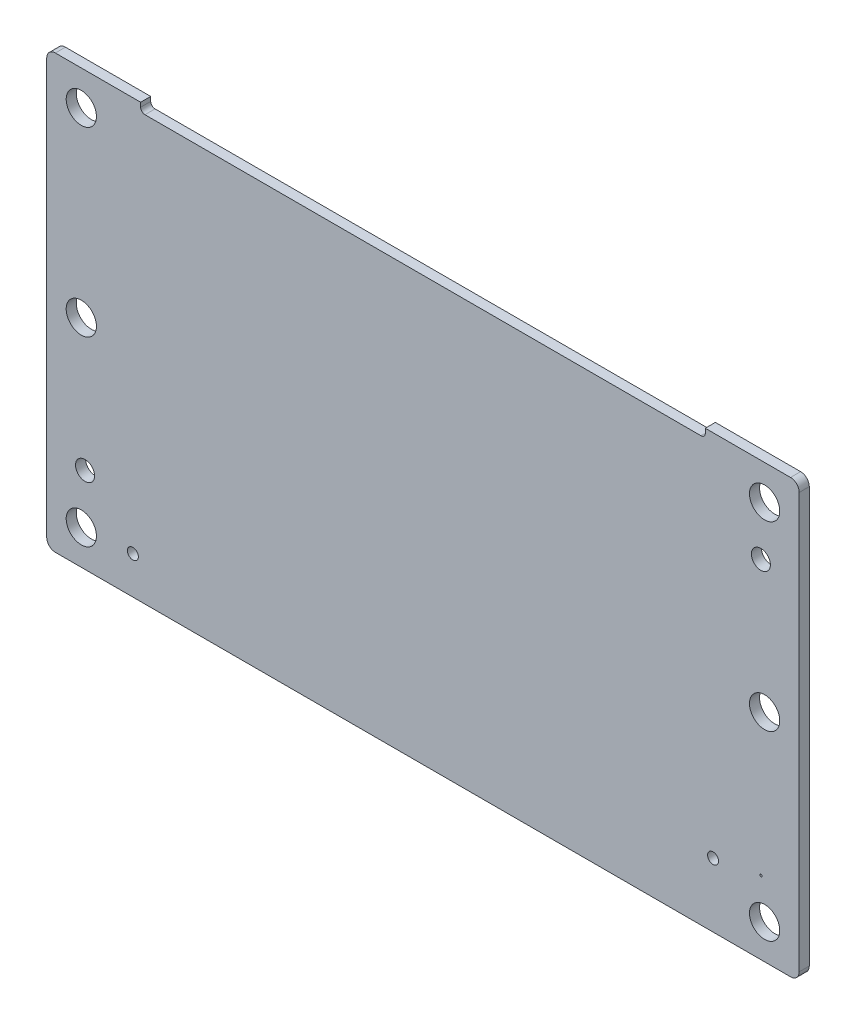
ISO-10303-21;
HEADER;
FILE_DESCRIPTION(('STEP AP214'),'2;1');
FILE_NAME('part.step','',(''),(''),'','','');
FILE_SCHEMA(('AUTOMOTIVE_DESIGN { 1 0 10303 214 1 1 1 1 }'));
ENDSEC;
DATA;
#1=APPLICATION_CONTEXT('core data for automotive mechanical design processes');
#2=APPLICATION_PROTOCOL_DEFINITION('international standard','automotive_design',2000,#1);
#3=PRODUCT_CONTEXT('',#1,'mechanical');
#4=PRODUCT('Part','Part','',(#3));
#5=PRODUCT_RELATED_PRODUCT_CATEGORY('part','',(#4));
#6=PRODUCT_DEFINITION_FORMATION('','',#4);
#7=PRODUCT_DEFINITION_CONTEXT('part definition',#1,'design');
#8=PRODUCT_DEFINITION('design','',#6,#7);
#9=PRODUCT_DEFINITION_SHAPE('','',#8);
#10=(LENGTH_UNIT() NAMED_UNIT(*) SI_UNIT(.MILLI.,.METRE.));
#11=(NAMED_UNIT(*) PLANE_ANGLE_UNIT() SI_UNIT($,.RADIAN.));
#12=(NAMED_UNIT(*) SI_UNIT($,.STERADIAN.) SOLID_ANGLE_UNIT());
#13=UNCERTAINTY_MEASURE_WITH_UNIT(LENGTH_MEASURE(1.E-05),#10,'distance_accuracy_value','');
#14=(GEOMETRIC_REPRESENTATION_CONTEXT(3) GLOBAL_UNCERTAINTY_ASSIGNED_CONTEXT((#13)) GLOBAL_UNIT_ASSIGNED_CONTEXT((#10,
#11,#12)) REPRESENTATION_CONTEXT('',''));
#15=CARTESIAN_POINT('',(0.,0.,0.));
#16=DIRECTION('',(0.,0.,1.));
#17=DIRECTION('',(1.,0.,0.));
#18=AXIS2_PLACEMENT_3D('',#15,#16,#17);
#19=CARTESIAN_POINT('',(0.,0.,1.16399999999992));
#20=DIRECTION('',(0.,0.,1.));
#21=DIRECTION('',(1.,0.,0.));
#22=AXIS2_PLACEMENT_3D('',#19,#20,#21);
#23=PLANE('',#22);
#24=CARTESIAN_POINT('',(0.4319999996,5.9180000004,1.16399999999992));
#25=DIRECTION('',(0.,0.,1.));
#26=DIRECTION('',(1.,0.,0.));
#27=AXIS2_PLACEMENT_3D('',#24,#25,#26);
#28=CIRCLE('',#27,1.0999999971);
#29=CARTESIAN_POINT('',(1.5319999967,5.9180000004,1.16399999999992));
#30=VERTEX_POINT('',#29);
#31=EDGE_CURVE('E222',#30,#30,#28,.F.);
#32=ORIENTED_EDGE('',*,*,#31,.T.);
#33=EDGE_LOOP('',(#32));
#34=FACE_BOUND('',#33,.T.);
#35=CARTESIAN_POINT('',(78.5700000098,4.4300000046,1.16399999999992));
#36=DIRECTION('',(0.,0.,1.));
#37=DIRECTION('',(1.,0.,0.));
#38=AXIS2_PLACEMENT_3D('',#35,#36,#37);
#39=CIRCLE('',#38,0.125000004);
#40=CARTESIAN_POINT('',(78.6950000138,4.4300000046,1.16399999999992));
#41=VERTEX_POINT('',#40);
#42=EDGE_CURVE('E225',#41,#41,#39,.F.);
#43=ORIENTED_EDGE('',*,*,#42,.T.);
#44=EDGE_LOOP('',(#43));
#45=FACE_BOUND('',#44,.T.);
#46=CARTESIAN_POINT('',(78.5700000098,36.0800000014,1.16399999999992));
#47=DIRECTION('',(0.,0.,1.));
#48=DIRECTION('',(1.,0.,0.));
#49=AXIS2_PLACEMENT_3D('',#46,#47,#48);
#50=CIRCLE('',#49,1.0999999971);
#51=CARTESIAN_POINT('',(79.6700000069,36.0800000014,1.16399999999992));
#52=VERTEX_POINT('',#51);
#53=EDGE_CURVE('E228',#52,#52,#50,.F.);
#54=ORIENTED_EDGE('',*,*,#53,.T.);
#55=EDGE_LOOP('',(#54));
#56=FACE_BOUND('',#55,.T.);
#57=CARTESIAN_POINT('',(78.999999988,41.9999999978,1.16399999999992));
#58=DIRECTION('',(0.,0.,1.));
#59=DIRECTION('',(1.,0.,0.));
#60=AXIS2_PLACEMENT_3D('',#57,#58,#59);
#61=CIRCLE('',#60,1.7500000052);
#62=CARTESIAN_POINT('',(80.7499999932,41.9999999978,1.16399999999992));
#63=VERTEX_POINT('',#62);
#64=EDGE_CURVE('E231',#63,#63,#61,.F.);
#65=ORIENTED_EDGE('',*,*,#64,.T.);
#66=EDGE_LOOP('',(#65));
#67=FACE_BOUND('',#66,.T.);
#68=CARTESIAN_POINT('',(78.999999988,21.0000000116,1.16399999999992));
#69=DIRECTION('',(0.,0.,1.));
#70=DIRECTION('',(1.,0.,0.));
#71=AXIS2_PLACEMENT_3D('',#68,#69,#70);
#72=CIRCLE('',#71,1.7500000052);
#73=CARTESIAN_POINT('',(80.7499999932,21.0000000116,1.16399999999992));
#74=VERTEX_POINT('',#73);
#75=EDGE_CURVE('E234',#74,#74,#72,.F.);
#76=ORIENTED_EDGE('',*,*,#75,.T.);
#77=EDGE_LOOP('',(#76));
#78=FACE_BOUND('',#77,.T.);
#79=CARTESIAN_POINT('',(78.999999988,0.,1.16399999999992));
#80=DIRECTION('',(0.,0.,1.));
#81=DIRECTION('',(1.,0.,0.));
#82=AXIS2_PLACEMENT_3D('',#79,#80,#81);
#83=CIRCLE('',#82,1.7500000052);
#84=CARTESIAN_POINT('',(80.7499999932,0.,1.16399999999992));
#85=VERTEX_POINT('',#84);
#86=EDGE_CURVE('E237',#85,#85,#83,.F.);
#87=ORIENTED_EDGE('',*,*,#86,.T.);
#88=EDGE_LOOP('',(#87));
#89=FACE_BOUND('',#88,.T.);
#90=CARTESIAN_POINT('',(0.,41.9999999978,1.16399999999992));
#91=DIRECTION('',(0.,0.,1.));
#92=DIRECTION('',(1.,0.,0.));
#93=AXIS2_PLACEMENT_3D('',#90,#91,#92);
#94=CIRCLE('',#93,1.7500000052);
#95=CARTESIAN_POINT('',(1.7500000052,41.9999999978,1.16399999999992));
#96=VERTEX_POINT('',#95);
#97=EDGE_CURVE('E240',#96,#96,#94,.F.);
#98=ORIENTED_EDGE('',*,*,#97,.T.);
#99=EDGE_LOOP('',(#98));
#100=FACE_BOUND('',#99,.T.);
#101=CARTESIAN_POINT('',(0.,21.0000000116,1.16399999999992));
#102=DIRECTION('',(0.,0.,1.));
#103=DIRECTION('',(1.,0.,0.));
#104=AXIS2_PLACEMENT_3D('',#101,#102,#103);
#105=CIRCLE('',#104,1.7500000052);
#106=CARTESIAN_POINT('',(1.7500000052,21.0000000116,1.16399999999992));
#107=VERTEX_POINT('',#106);
#108=EDGE_CURVE('E243',#107,#107,#105,.F.);
#109=ORIENTED_EDGE('',*,*,#108,.T.);
#110=EDGE_LOOP('',(#109));
#111=FACE_BOUND('',#110,.T.);
#112=CARTESIAN_POINT('',(0.,0.,1.16399999999992));
#113=DIRECTION('',(0.,0.,1.));
#114=DIRECTION('',(1.,0.,0.));
#115=AXIS2_PLACEMENT_3D('',#112,#113,#114);
#116=CIRCLE('',#115,1.7500000052);
#117=CARTESIAN_POINT('',(1.7500000052,0.,1.16399999999992));
#118=VERTEX_POINT('',#117);
#119=EDGE_CURVE('E246',#118,#118,#116,.F.);
#120=ORIENTED_EDGE('',*,*,#119,.T.);
#121=EDGE_LOOP('',(#120));
#122=FACE_BOUND('',#121,.T.);
#123=CARTESIAN_POINT('',(5.9599999926,0.3500000112,1.16399999999992));
#124=DIRECTION('',(0.,0.,1.));
#125=DIRECTION('',(1.,0.,0.));
#126=AXIS2_PLACEMENT_3D('',#123,#124,#125);
#127=CIRCLE('',#126,0.635);
#128=CARTESIAN_POINT('',(6.5949999926,0.3500000112,1.16399999999992));
#129=VERTEX_POINT('',#128);
#130=EDGE_CURVE('E249',#129,#129,#127,.F.);
#131=ORIENTED_EDGE('',*,*,#130,.T.);
#132=EDGE_LOOP('',(#131));
#133=FACE_BOUND('',#132,.T.);
#134=CARTESIAN_POINT('',(73.0399999954,3.4000000072,1.16399999999992));
#135=DIRECTION('',(0.,0.,1.));
#136=DIRECTION('',(1.,0.,0.));
#137=AXIS2_PLACEMENT_3D('',#134,#135,#136);
#138=CIRCLE('',#137,0.635);
#139=CARTESIAN_POINT('',(73.6749999954,3.4000000072,1.16399999999992));
#140=VERTEX_POINT('',#139);
#141=EDGE_CURVE('E252',#140,#140,#138,.F.);
#142=ORIENTED_EDGE('',*,*,#141,.T.);
#143=EDGE_LOOP('',(#142));
#144=FACE_BOUND('',#143,.T.);
#145=DIRECTION('',(0.,1.,0.));
#146=VECTOR('',#145,1.);
#147=CARTESIAN_POINT('',(6.8600000000005,45.4999999999958,1.16399999999992));
#148=LINE('',#147,#146);
#149=CARTESIAN_POINT('',(6.8600000000005,45.9999999999938,1.16399999999992));
#150=VERTEX_POINT('',#149);
#151=CARTESIAN_POINT('',(6.8600000000005,45.4999999999958,1.16399999999992));
#152=VERTEX_POINT('',#151);
#153=EDGE_CURVE('E125',#150,#152,#148,.F.);
#154=ORIENTED_EDGE('',*,*,#153,.F.);
#155=DIRECTION('',(1.,0.,0.));
#156=VECTOR('',#155,1.);
#157=CARTESIAN_POINT('',(6.8600000000005,45.9999999999938,1.16399999999992));
#158=LINE('',#157,#156);
#159=CARTESIAN_POINT('',(-3.0000000000007,45.9999999999958,1.16399999999992));
#160=VERTEX_POINT('',#159);
#161=EDGE_CURVE('E121',#160,#150,#158,.T.);
#162=ORIENTED_EDGE('',*,*,#161,.F.);
#163=CARTESIAN_POINT('',(-3.0000000000007,44.9999999999978,1.16399999999992));
#164=DIRECTION('',(0.,0.,1.));
#165=DIRECTION('',(1.,0.,0.));
#166=AXIS2_PLACEMENT_3D('',#163,#164,#165);
#167=CIRCLE('',#166,1.00000000000006);
#168=CARTESIAN_POINT('',(-3.99999999999924,44.9999999999978,1.16399999999992));
#169=VERTEX_POINT('',#168);
#170=EDGE_CURVE('E20',#169,#160,#167,.F.);
#171=ORIENTED_EDGE('',*,*,#170,.F.);
#172=DIRECTION('',(0.,1.,0.));
#173=VECTOR('',#172,1.);
#174=CARTESIAN_POINT('',(-3.99999999999924,44.9999999999978,1.16399999999992));
#175=LINE('',#174,#173);
#176=CARTESIAN_POINT('',(-4.,-3.0000000000007,1.16399999999992));
#177=VERTEX_POINT('',#176);
#178=EDGE_CURVE('E108',#177,#169,#175,.T.);
#179=ORIENTED_EDGE('',*,*,#178,.F.);
#180=CARTESIAN_POINT('',(-3.0000000000007,-3.0000000000007,1.16399999999992));
#181=DIRECTION('',(0.,0.,1.));
#182=DIRECTION('',(1.,0.,0.));
#183=AXIS2_PLACEMENT_3D('',#180,#181,#182);
#184=CIRCLE('',#183,1.00000000000006);
#185=CARTESIAN_POINT('',(-3.0000000000007,-3.99999999999924,1.16399999999992));
#186=VERTEX_POINT('',#185);
#187=EDGE_CURVE('E264',#186,#177,#184,.F.);
#188=ORIENTED_EDGE('',*,*,#187,.F.);
#189=DIRECTION('',(1.,0.,0.));
#190=VECTOR('',#189,1.);
#191=CARTESIAN_POINT('',(-3.0000000000007,-3.99999999999924,1.16399999999992));
#192=LINE('',#191,#190);
#193=CARTESIAN_POINT('',(82.0000000000022,-4.,1.16399999999992));
#194=VERTEX_POINT('',#193);
#195=EDGE_CURVE('E165',#194,#186,#192,.F.);
#196=ORIENTED_EDGE('',*,*,#195,.F.);
#197=CARTESIAN_POINT('',(82.0000000000022,-3.0000000000007,1.16399999999992));
#198=DIRECTION('',(0.,0.,1.));
#199=DIRECTION('',(1.,0.,0.));
#200=AXIS2_PLACEMENT_3D('',#197,#198,#199);
#201=CIRCLE('',#200,1.00000000000006);
#202=CARTESIAN_POINT('',(82.9999999999982,-3.0000000000007,1.16399999999992));
#203=VERTEX_POINT('',#202);
#204=EDGE_CURVE('E263',#203,#194,#201,.F.);
#205=ORIENTED_EDGE('',*,*,#204,.F.);
#206=DIRECTION('',(0.,1.,0.));
#207=VECTOR('',#206,1.);
#208=CARTESIAN_POINT('',(82.9999999999982,-3.0000000000007,1.16399999999992));
#209=LINE('',#208,#207);
#210=CARTESIAN_POINT('',(83.0000000000002,44.9999999999978,1.16399999999992));
#211=VERTEX_POINT('',#210);
#212=EDGE_CURVE('E161',#211,#203,#209,.F.);
#213=ORIENTED_EDGE('',*,*,#212,.F.);
#214=CARTESIAN_POINT('',(82.0000000000022,44.9999999999978,1.16399999999992));
#215=DIRECTION('',(0.,0.,1.));
#216=DIRECTION('',(1.,0.,0.));
#217=AXIS2_PLACEMENT_3D('',#214,#215,#216);
#218=CIRCLE('',#217,1.00000000000006);
#219=CARTESIAN_POINT('',(82.0000000000022,45.9999999999938,1.16399999999992));
#220=VERTEX_POINT('',#219);
#221=EDGE_CURVE('E261',#220,#211,#218,.F.);
#222=ORIENTED_EDGE('',*,*,#221,.F.);
#223=DIRECTION('',(1.,0.,0.));
#224=VECTOR('',#223,1.);
#225=CARTESIAN_POINT('',(82.0000000000022,45.9999999999938,1.16399999999992));
#226=LINE('',#225,#224);
#227=CARTESIAN_POINT('',(72.140000000001,45.9999999999938,1.16399999999992));
#228=VERTEX_POINT('',#227);
#229=EDGE_CURVE('E156',#228,#220,#226,.T.);
#230=ORIENTED_EDGE('',*,*,#229,.F.);
#231=DIRECTION('',(0.,1.,0.));
#232=VECTOR('',#231,1.);
#233=CARTESIAN_POINT('',(72.140000000001,45.9999999999938,1.16399999999992));
#234=LINE('',#233,#232);
#235=CARTESIAN_POINT('',(72.140000000002,45.4999999999958,1.16399999999992));
#236=VERTEX_POINT('',#235);
#237=EDGE_CURVE('E149',#236,#228,#234,.T.);
#238=ORIENTED_EDGE('',*,*,#237,.F.);
#239=CARTESIAN_POINT('',(71.640000000003,45.4999999999958,1.16399999999992));
#240=DIRECTION('',(0.,0.,1.));
#241=DIRECTION('',(1.,0.,0.));
#242=AXIS2_PLACEMENT_3D('',#239,#240,#241);
#243=CIRCLE('',#242,0.500000000000032);
#244=CARTESIAN_POINT('',(71.640000000003,44.9999999999978,1.16399999999992));
#245=VERTEX_POINT('',#244);
#246=EDGE_CURVE('E148',#236,#245,#243,.F.);
#247=ORIENTED_EDGE('',*,*,#246,.T.);
#248=DIRECTION('',(1.,0.,0.));
#249=VECTOR('',#248,1.);
#250=CARTESIAN_POINT('',(71.640000000003,44.9999999999978,1.16399999999992));
#251=LINE('',#250,#249);
#252=CARTESIAN_POINT('',(7.36000000000104,44.9999999999968,1.16399999999992));
#253=VERTEX_POINT('',#252);
#254=EDGE_CURVE('E145',#253,#245,#251,.T.);
#255=ORIENTED_EDGE('',*,*,#254,.F.);
#256=CARTESIAN_POINT('',(7.36000000000104,45.4999999999958,1.16399999999992));
#257=DIRECTION('',(0.,0.,1.));
#258=DIRECTION('',(1.,0.,0.));
#259=AXIS2_PLACEMENT_3D('',#256,#257,#258);
#260=CIRCLE('',#259,0.500000000000032);
#261=EDGE_CURVE('E255',#253,#152,#260,.F.);
#262=ORIENTED_EDGE('',*,*,#261,.T.);
#263=EDGE_LOOP('',(#154,#162,#171,#179,#188,#196,#205,#213,#222,#230,#238,#247,#255,#262));
#264=FACE_BOUND('',#263,.T.);
#265=ADVANCED_FACE('F17',(#34,#45,#56,#67,#78,#89,#100,#111,#122,#133,#144,#264),#23,.T.);
#266=CARTESIAN_POINT('',(6.8600000000005,45.9999999999938,0.));
#267=DIRECTION('',(0.,1.,0.));
#268=DIRECTION('',(0.,0.,1.));
#269=AXIS2_PLACEMENT_3D('',#266,#267,#268);
#270=PLANE('',#269);
#271=DIRECTION('',(0.,0.,-1.));
#272=VECTOR('',#271,1.);
#273=CARTESIAN_POINT('',(6.8600000000005,45.9999999999938,0.));
#274=LINE('',#273,#272);
#275=CARTESIAN_POINT('',(6.8600000000005,45.9999999999938,0.));
#276=VERTEX_POINT('',#275);
#277=EDGE_CURVE('E140',#276,#150,#274,.F.);
#278=ORIENTED_EDGE('',*,*,#277,.F.);
#279=DIRECTION('',(1.,0.,0.));
#280=VECTOR('',#279,1.);
#281=CARTESIAN_POINT('',(0.,45.9999999999938,0.));
#282=LINE('',#281,#280);
#283=CARTESIAN_POINT('',(-3.0000000000007,45.9999999999958,0.));
#284=VERTEX_POINT('',#283);
#285=EDGE_CURVE('E133',#276,#284,#282,.F.);
#286=ORIENTED_EDGE('',*,*,#285,.T.);
#287=DIRECTION('',(0.,0.,1.));
#288=VECTOR('',#287,1.);
#289=CARTESIAN_POINT('',(-3.0000000000007,45.9999999999979,0.));
#290=LINE('',#289,#288);
#291=EDGE_CURVE('E117',#160,#284,#290,.F.);
#292=ORIENTED_EDGE('',*,*,#291,.F.);
#293=ORIENTED_EDGE('',*,*,#161,.T.);
#294=EDGE_LOOP('',(#278,#286,#292,#293));
#295=FACE_BOUND('',#294,.T.);
#296=ADVANCED_FACE('F131',(#295),#270,.T.);
#297=CARTESIAN_POINT('',(-3.0000000000007,44.9999999999978,0.));
#298=DIRECTION('',(0.,0.,1.));
#299=DIRECTION('',(1.,0.,0.));
#300=AXIS2_PLACEMENT_3D('',#297,#298,#299);
#301=CYLINDRICAL_SURFACE('',#300,1.00000000000006);
#302=ORIENTED_EDGE('',*,*,#291,.T.);
#303=CARTESIAN_POINT('',(-3.0000000000007,44.9999999999978,0.));
#304=DIRECTION('',(0.,0.,1.));
#305=DIRECTION('',(1.,0.,0.));
#306=AXIS2_PLACEMENT_3D('',#303,#304,#305);
#307=CIRCLE('',#306,1.00000000000006);
#308=CARTESIAN_POINT('',(-3.99999999999924,44.9999999999978,0.));
#309=VERTEX_POINT('',#308);
#310=EDGE_CURVE('E220',#284,#309,#307,.T.);
#311=ORIENTED_EDGE('',*,*,#310,.T.);
#312=DIRECTION('',(0.,0.,1.));
#313=VECTOR('',#312,1.);
#314=CARTESIAN_POINT('',(-3.99999999999924,44.9999999999978,0.));
#315=LINE('',#314,#313);
#316=EDGE_CURVE('E119',#169,#309,#315,.F.);
#317=ORIENTED_EDGE('',*,*,#316,.F.);
#318=ORIENTED_EDGE('',*,*,#170,.T.);
#319=EDGE_LOOP('',(#302,#311,#317,#318));
#320=FACE_BOUND('',#319,.T.);
#321=ADVANCED_FACE('F114',(#320),#301,.T.);
#322=CARTESIAN_POINT('',(-3.99999999999924,44.9999999999978,0.));
#323=DIRECTION('',(-1.,0.,0.));
#324=DIRECTION('',(0.,0.,1.));
#325=AXIS2_PLACEMENT_3D('',#322,#323,#324);
#326=PLANE('',#325);
#327=ORIENTED_EDGE('',*,*,#316,.T.);
#328=DIRECTION('',(0.,1.,0.));
#329=VECTOR('',#328,1.);
#330=CARTESIAN_POINT('',(-3.99999999999924,0.,0.));
#331=LINE('',#330,#329);
#332=CARTESIAN_POINT('',(-4.,-3.0000000000007,0.));
#333=VERTEX_POINT('',#332);
#334=EDGE_CURVE('E219',#309,#333,#331,.F.);
#335=ORIENTED_EDGE('',*,*,#334,.T.);
#336=DIRECTION('',(0.,0.,1.));
#337=VECTOR('',#336,1.);
#338=CARTESIAN_POINT('',(-4.00000000000076,-3.0000000000007,0.));
#339=LINE('',#338,#337);
#340=EDGE_CURVE('E167',#177,#333,#339,.F.);
#341=ORIENTED_EDGE('',*,*,#340,.F.);
#342=ORIENTED_EDGE('',*,*,#178,.T.);
#343=EDGE_LOOP('',(#327,#335,#341,#342));
#344=FACE_BOUND('',#343,.T.);
#345=ADVANCED_FACE('F270',(#344),#326,.T.);
#346=CARTESIAN_POINT('',(-3.0000000000007,-3.0000000000007,0.));
#347=DIRECTION('',(0.,0.,1.));
#348=DIRECTION('',(1.,0.,0.));
#349=AXIS2_PLACEMENT_3D('',#346,#347,#348);
#350=CYLINDRICAL_SURFACE('',#349,1.00000000000006);
#351=ORIENTED_EDGE('',*,*,#340,.T.);
#352=CARTESIAN_POINT('',(-3.0000000000007,-3.0000000000007,0.));
#353=DIRECTION('',(0.,0.,1.));
#354=DIRECTION('',(1.,0.,0.));
#355=AXIS2_PLACEMENT_3D('',#352,#353,#354);
#356=CIRCLE('',#355,1.00000000000006);
#357=CARTESIAN_POINT('',(-3.0000000000007,-3.99999999999924,0.));
#358=VERTEX_POINT('',#357);
#359=EDGE_CURVE('E216',#333,#358,#356,.T.);
#360=ORIENTED_EDGE('',*,*,#359,.T.);
#361=DIRECTION('',(0.,0.,-1.));
#362=VECTOR('',#361,1.);
#363=CARTESIAN_POINT('',(-3.0000000000007,-3.99999999999924,0.));
#364=LINE('',#363,#362);
#365=EDGE_CURVE('E166',#186,#358,#364,.T.);
#366=ORIENTED_EDGE('',*,*,#365,.F.);
#367=ORIENTED_EDGE('',*,*,#187,.T.);
#368=EDGE_LOOP('',(#351,#360,#366,#367));
#369=FACE_BOUND('',#368,.T.);
#370=ADVANCED_FACE('F307',(#369),#350,.T.);
#371=CARTESIAN_POINT('',(-3.0000000000007,-3.99999999999924,0.));
#372=DIRECTION('',(0.,-1.,0.));
#373=DIRECTION('',(0.,0.,-1.));
#374=AXIS2_PLACEMENT_3D('',#371,#372,#373);
#375=PLANE('',#374);
#376=ORIENTED_EDGE('',*,*,#365,.T.);
#377=DIRECTION('',(1.,0.,0.));
#378=VECTOR('',#377,1.);
#379=CARTESIAN_POINT('',(0.,-3.99999999999924,0.));
#380=LINE('',#379,#378);
#381=CARTESIAN_POINT('',(82.0000000000022,-4.,0.));
#382=VERTEX_POINT('',#381);
#383=EDGE_CURVE('E215',#358,#382,#380,.T.);
#384=ORIENTED_EDGE('',*,*,#383,.T.);
#385=DIRECTION('',(0.,0.,1.));
#386=VECTOR('',#385,1.);
#387=CARTESIAN_POINT('',(82.0000000000022,-4.00000000000076,0.));
#388=LINE('',#387,#386);
#389=EDGE_CURVE('E164',#194,#382,#388,.F.);
#390=ORIENTED_EDGE('',*,*,#389,.F.);
#391=ORIENTED_EDGE('',*,*,#195,.T.);
#392=EDGE_LOOP('',(#376,#384,#390,#391));
#393=FACE_BOUND('',#392,.T.);
#394=ADVANCED_FACE('F302',(#393),#375,.T.);
#395=CARTESIAN_POINT('',(82.0000000000022,-3.0000000000007,0.));
#396=DIRECTION('',(0.,0.,1.));
#397=DIRECTION('',(1.,0.,0.));
#398=AXIS2_PLACEMENT_3D('',#395,#396,#397);
#399=CYLINDRICAL_SURFACE('',#398,1.00000000000006);
#400=ORIENTED_EDGE('',*,*,#389,.T.);
#401=CARTESIAN_POINT('',(82.0000000000022,-3.0000000000007,0.));
#402=DIRECTION('',(0.,0.,1.));
#403=DIRECTION('',(1.,0.,0.));
#404=AXIS2_PLACEMENT_3D('',#401,#402,#403);
#405=CIRCLE('',#404,1.00000000000006);
#406=CARTESIAN_POINT('',(82.9999999999982,-3.0000000000007,0.));
#407=VERTEX_POINT('',#406);
#408=EDGE_CURVE('E212',#382,#407,#405,.T.);
#409=ORIENTED_EDGE('',*,*,#408,.T.);
#410=DIRECTION('',(0.,0.,-1.));
#411=VECTOR('',#410,1.);
#412=CARTESIAN_POINT('',(82.9999999999982,-3.0000000000007,0.));
#413=LINE('',#412,#411);
#414=EDGE_CURVE('E163',#203,#407,#413,.T.);
#415=ORIENTED_EDGE('',*,*,#414,.F.);
#416=ORIENTED_EDGE('',*,*,#204,.T.);
#417=EDGE_LOOP('',(#400,#409,#415,#416));
#418=FACE_BOUND('',#417,.T.);
#419=ADVANCED_FACE('F315',(#418),#399,.T.);
#420=CARTESIAN_POINT('',(82.9999999999982,-3.0000000000007,0.));
#421=DIRECTION('',(1.,0.,0.));
#422=DIRECTION('',(0.,0.,-1.));
#423=AXIS2_PLACEMENT_3D('',#420,#421,#422);
#424=PLANE('',#423);
#425=ORIENTED_EDGE('',*,*,#414,.T.);
#426=DIRECTION('',(0.,1.,0.));
#427=VECTOR('',#426,1.);
#428=CARTESIAN_POINT('',(82.9999999999982,0.,0.));
#429=LINE('',#428,#427);
#430=CARTESIAN_POINT('',(83.0000000000002,44.9999999999978,0.));
#431=VERTEX_POINT('',#430);
#432=EDGE_CURVE('E211',#407,#431,#429,.T.);
#433=ORIENTED_EDGE('',*,*,#432,.T.);
#434=DIRECTION('',(0.,0.,1.));
#435=VECTOR('',#434,1.);
#436=CARTESIAN_POINT('',(83.0000000000023,44.9999999999978,0.));
#437=LINE('',#436,#435);
#438=EDGE_CURVE('E158',#211,#431,#437,.F.);
#439=ORIENTED_EDGE('',*,*,#438,.F.);
#440=ORIENTED_EDGE('',*,*,#212,.T.);
#441=EDGE_LOOP('',(#425,#433,#439,#440));
#442=FACE_BOUND('',#441,.T.);
#443=ADVANCED_FACE('F396',(#442),#424,.T.);
#444=CARTESIAN_POINT('',(82.0000000000022,44.9999999999978,0.));
#445=DIRECTION('',(0.,0.,1.));
#446=DIRECTION('',(1.,0.,0.));
#447=AXIS2_PLACEMENT_3D('',#444,#445,#446);
#448=CYLINDRICAL_SURFACE('',#447,1.00000000000006);
#449=ORIENTED_EDGE('',*,*,#438,.T.);
#450=CARTESIAN_POINT('',(82.0000000000022,44.9999999999978,0.));
#451=DIRECTION('',(0.,0.,1.));
#452=DIRECTION('',(1.,0.,0.));
#453=AXIS2_PLACEMENT_3D('',#450,#451,#452);
#454=CIRCLE('',#453,1.00000000000006);
#455=CARTESIAN_POINT('',(82.0000000000022,45.9999999999938,0.));
#456=VERTEX_POINT('',#455);
#457=EDGE_CURVE('E207',#431,#456,#454,.T.);
#458=ORIENTED_EDGE('',*,*,#457,.T.);
#459=DIRECTION('',(0.,0.,1.));
#460=VECTOR('',#459,1.);
#461=CARTESIAN_POINT('',(82.0000000000022,45.9999999999938,0.));
#462=LINE('',#461,#460);
#463=EDGE_CURVE('E153',#220,#456,#462,.F.);
#464=ORIENTED_EDGE('',*,*,#463,.F.);
#465=ORIENTED_EDGE('',*,*,#221,.T.);
#466=EDGE_LOOP('',(#449,#458,#464,#465));
#467=FACE_BOUND('',#466,.T.);
#468=ADVANCED_FACE('F392',(#467),#448,.T.);
#469=CARTESIAN_POINT('',(82.0000000000022,45.9999999999938,0.));
#470=DIRECTION('',(0.,1.,0.));
#471=DIRECTION('',(0.,0.,1.));
#472=AXIS2_PLACEMENT_3D('',#469,#470,#471);
#473=PLANE('',#472);
#474=ORIENTED_EDGE('',*,*,#463,.T.);
#475=DIRECTION('',(1.,0.,0.));
#476=VECTOR('',#475,1.);
#477=CARTESIAN_POINT('',(0.,45.9999999999938,0.));
#478=LINE('',#477,#476);
#479=CARTESIAN_POINT('',(72.140000000001,45.9999999999938,0.));
#480=VERTEX_POINT('',#479);
#481=EDGE_CURVE('E210',#456,#480,#478,.F.);
#482=ORIENTED_EDGE('',*,*,#481,.T.);
#483=DIRECTION('',(0.,0.,1.));
#484=VECTOR('',#483,1.);
#485=CARTESIAN_POINT('',(72.140000000001,45.9999999999938,0.));
#486=LINE('',#485,#484);
#487=EDGE_CURVE('E152',#228,#480,#486,.F.);
#488=ORIENTED_EDGE('',*,*,#487,.F.);
#489=ORIENTED_EDGE('',*,*,#229,.T.);
#490=EDGE_LOOP('',(#474,#482,#488,#489));
#491=FACE_BOUND('',#490,.T.);
#492=ADVANCED_FACE('F388',(#491),#473,.T.);
#493=CARTESIAN_POINT('',(72.140000000001,45.9999999999938,0.));
#494=DIRECTION('',(-1.,0.,0.));
#495=DIRECTION('',(0.,0.,1.));
#496=AXIS2_PLACEMENT_3D('',#493,#494,#495);
#497=PLANE('',#496);
#498=ORIENTED_EDGE('',*,*,#487,.T.);
#499=DIRECTION('',(0.,1.,0.));
#500=VECTOR('',#499,1.);
#501=CARTESIAN_POINT('',(72.140000000001,0.,0.));
#502=LINE('',#501,#500);
#503=CARTESIAN_POINT('',(72.140000000002,45.4999999999958,0.));
#504=VERTEX_POINT('',#503);
#505=EDGE_CURVE('E206',#480,#504,#502,.F.);
#506=ORIENTED_EDGE('',*,*,#505,.T.);
#507=DIRECTION('',(0.,0.,1.));
#508=VECTOR('',#507,1.);
#509=CARTESIAN_POINT('',(72.140000000003,45.4999999999958,0.));
#510=LINE('',#509,#508);
#511=EDGE_CURVE('E260',#504,#236,#510,.T.);
#512=ORIENTED_EDGE('',*,*,#511,.T.);
#513=ORIENTED_EDGE('',*,*,#237,.T.);
#514=EDGE_LOOP('',(#498,#506,#512,#513));
#515=FACE_BOUND('',#514,.T.);
#516=ADVANCED_FACE('F384',(#515),#497,.T.);
#517=CARTESIAN_POINT('',(71.640000000003,45.4999999999958,0.));
#518=DIRECTION('',(0.,0.,1.));
#519=DIRECTION('',(1.,0.,0.));
#520=AXIS2_PLACEMENT_3D('',#517,#518,#519);
#521=CYLINDRICAL_SURFACE('',#520,0.500000000000032);
#522=ORIENTED_EDGE('',*,*,#246,.F.);
#523=ORIENTED_EDGE('',*,*,#511,.F.);
#524=CARTESIAN_POINT('',(71.640000000003,45.4999999999958,0.));
#525=DIRECTION('',(0.,0.,1.));
#526=DIRECTION('',(1.,0.,0.));
#527=AXIS2_PLACEMENT_3D('',#524,#525,#526);
#528=CIRCLE('',#527,0.500000000000032);
#529=CARTESIAN_POINT('',(71.640000000003,44.9999999999978,0.));
#530=VERTEX_POINT('',#529);
#531=EDGE_CURVE('E203',#504,#530,#528,.F.);
#532=ORIENTED_EDGE('',*,*,#531,.T.);
#533=DIRECTION('',(0.,0.,1.));
#534=VECTOR('',#533,1.);
#535=CARTESIAN_POINT('',(71.640000000003,44.9999999999978,0.));
#536=LINE('',#535,#534);
#537=EDGE_CURVE('E147',#245,#530,#536,.F.);
#538=ORIENTED_EDGE('',*,*,#537,.F.);
#539=EDGE_LOOP('',(#522,#523,#532,#538));
#540=FACE_BOUND('',#539,.T.);
#541=ADVANCED_FACE('F380',(#540),#521,.F.);
#542=CARTESIAN_POINT('',(71.640000000003,44.9999999999978,0.));
#543=DIRECTION('',(0.,1.,0.));
#544=DIRECTION('',(0.,0.,1.));
#545=AXIS2_PLACEMENT_3D('',#542,#543,#544);
#546=PLANE('',#545);
#547=ORIENTED_EDGE('',*,*,#537,.T.);
#548=DIRECTION('',(1.,0.,0.));
#549=VECTOR('',#548,1.);
#550=CARTESIAN_POINT('',(0.,44.9999999999978,0.));
#551=LINE('',#550,#549);
#552=CARTESIAN_POINT('',(7.36000000000104,44.9999999999968,0.));
#553=VERTEX_POINT('',#552);
#554=EDGE_CURVE('E202',#530,#553,#551,.F.);
#555=ORIENTED_EDGE('',*,*,#554,.T.);
#556=DIRECTION('',(0.,0.,1.));
#557=VECTOR('',#556,1.);
#558=CARTESIAN_POINT('',(7.36000000000104,44.9999999999958,0.));
#559=LINE('',#558,#557);
#560=EDGE_CURVE('E257',#553,#253,#559,.T.);
#561=ORIENTED_EDGE('',*,*,#560,.T.);
#562=ORIENTED_EDGE('',*,*,#254,.T.);
#563=EDGE_LOOP('',(#547,#555,#561,#562));
#564=FACE_BOUND('',#563,.T.);
#565=ADVANCED_FACE('F376',(#564),#546,.T.);
#566=CARTESIAN_POINT('',(7.36000000000104,45.4999999999958,0.));
#567=DIRECTION('',(0.,0.,1.));
#568=DIRECTION('',(1.,0.,0.));
#569=AXIS2_PLACEMENT_3D('',#566,#567,#568);
#570=CYLINDRICAL_SURFACE('',#569,0.500000000000032);
#571=ORIENTED_EDGE('',*,*,#261,.F.);
#572=ORIENTED_EDGE('',*,*,#560,.F.);
#573=CARTESIAN_POINT('',(7.36000000000104,45.4999999999958,0.));
#574=DIRECTION('',(0.,0.,1.));
#575=DIRECTION('',(1.,0.,0.));
#576=AXIS2_PLACEMENT_3D('',#573,#574,#575);
#577=CIRCLE('',#576,0.500000000000032);
#578=CARTESIAN_POINT('',(6.8600000000005,45.4999999999958,0.));
#579=VERTEX_POINT('',#578);
#580=EDGE_CURVE('E199',#553,#579,#577,.F.);
#581=ORIENTED_EDGE('',*,*,#580,.T.);
#582=DIRECTION('',(0.,0.,-1.));
#583=VECTOR('',#582,1.);
#584=CARTESIAN_POINT('',(6.8600000000005,45.4999999999958,0.));
#585=LINE('',#584,#583);
#586=EDGE_CURVE('E35',#152,#579,#585,.T.);
#587=ORIENTED_EDGE('',*,*,#586,.F.);
#588=EDGE_LOOP('',(#571,#572,#581,#587));
#589=FACE_BOUND('',#588,.T.);
#590=ADVANCED_FACE('F373',(#589),#570,.F.);
#591=CARTESIAN_POINT('',(6.8600000000005,45.4999999999958,0.));
#592=DIRECTION('',(1.,0.,0.));
#593=DIRECTION('',(0.,0.,-1.));
#594=AXIS2_PLACEMENT_3D('',#591,#592,#593);
#595=PLANE('',#594);
#596=ORIENTED_EDGE('',*,*,#586,.T.);
#597=DIRECTION('',(0.,1.,0.));
#598=VECTOR('',#597,1.);
#599=CARTESIAN_POINT('',(6.8600000000005,0.,0.));
#600=LINE('',#599,#598);
#601=EDGE_CURVE('E198',#579,#276,#600,.T.);
#602=ORIENTED_EDGE('',*,*,#601,.T.);
#603=ORIENTED_EDGE('',*,*,#277,.T.);
#604=ORIENTED_EDGE('',*,*,#153,.T.);
#605=EDGE_LOOP('',(#596,#602,#603,#604));
#606=FACE_BOUND('',#605,.T.);
#607=ADVANCED_FACE('F369',(#606),#595,.T.);
#608=CARTESIAN_POINT('',(73.0399999954,3.4000000072,0.));
#609=DIRECTION('',(0.,0.,1.));
#610=DIRECTION('',(1.,0.,0.));
#611=AXIS2_PLACEMENT_3D('',#608,#609,#610);
#612=CYLINDRICAL_SURFACE('',#611,0.635);
#613=ORIENTED_EDGE('',*,*,#141,.F.);
#614=EDGE_LOOP('',(#613));
#615=FACE_BOUND('',#614,.T.);
#616=CARTESIAN_POINT('',(73.0399999954,3.4000000072,0.));
#617=DIRECTION('',(0.,0.,1.));
#618=DIRECTION('',(1.,0.,0.));
#619=AXIS2_PLACEMENT_3D('',#616,#617,#618);
#620=CIRCLE('',#619,0.635);
#621=CARTESIAN_POINT('',(73.6749999954,3.4000000072,0.));
#622=VERTEX_POINT('',#621);
#623=EDGE_CURVE('E195',#622,#622,#620,.F.);
#624=ORIENTED_EDGE('',*,*,#623,.T.);
#625=EDGE_LOOP('',(#624));
#626=FACE_BOUND('',#625,.T.);
#627=ADVANCED_FACE('F365',(#615,#626),#612,.F.);
#628=CARTESIAN_POINT('',(5.9599999926,0.3500000112,0.));
#629=DIRECTION('',(0.,0.,1.));
#630=DIRECTION('',(1.,0.,0.));
#631=AXIS2_PLACEMENT_3D('',#628,#629,#630);
#632=CYLINDRICAL_SURFACE('',#631,0.635);
#633=ORIENTED_EDGE('',*,*,#130,.F.);
#634=EDGE_LOOP('',(#633));
#635=FACE_BOUND('',#634,.T.);
#636=CARTESIAN_POINT('',(5.9599999926,0.3500000112,0.));
#637=DIRECTION('',(0.,0.,1.));
#638=DIRECTION('',(1.,0.,0.));
#639=AXIS2_PLACEMENT_3D('',#636,#637,#638);
#640=CIRCLE('',#639,0.635);
#641=CARTESIAN_POINT('',(6.5949999926,0.3500000112,0.));
#642=VERTEX_POINT('',#641);
#643=EDGE_CURVE('E192',#642,#642,#640,.F.);
#644=ORIENTED_EDGE('',*,*,#643,.T.);
#645=EDGE_LOOP('',(#644));
#646=FACE_BOUND('',#645,.T.);
#647=ADVANCED_FACE('F361',(#635,#646),#632,.F.);
#648=CARTESIAN_POINT('',(0.,0.,0.));
#649=DIRECTION('',(0.,0.,1.));
#650=DIRECTION('',(1.,0.,0.));
#651=AXIS2_PLACEMENT_3D('',#648,#649,#650);
#652=CYLINDRICAL_SURFACE('',#651,1.7500000052);
#653=ORIENTED_EDGE('',*,*,#119,.F.);
#654=EDGE_LOOP('',(#653));
#655=FACE_BOUND('',#654,.T.);
#656=CARTESIAN_POINT('',(0.,0.,0.));
#657=DIRECTION('',(0.,0.,1.));
#658=DIRECTION('',(1.,0.,0.));
#659=AXIS2_PLACEMENT_3D('',#656,#657,#658);
#660=CIRCLE('',#659,1.7500000052);
#661=CARTESIAN_POINT('',(1.7500000052,0.,0.));
#662=VERTEX_POINT('',#661);
#663=EDGE_CURVE('E189',#662,#662,#660,.F.);
#664=ORIENTED_EDGE('',*,*,#663,.T.);
#665=EDGE_LOOP('',(#664));
#666=FACE_BOUND('',#665,.T.);
#667=ADVANCED_FACE('F357',(#655,#666),#652,.F.);
#668=CARTESIAN_POINT('',(0.,21.0000000116,0.));
#669=DIRECTION('',(0.,0.,1.));
#670=DIRECTION('',(1.,0.,0.));
#671=AXIS2_PLACEMENT_3D('',#668,#669,#670);
#672=CYLINDRICAL_SURFACE('',#671,1.7500000052);
#673=ORIENTED_EDGE('',*,*,#108,.F.);
#674=EDGE_LOOP('',(#673));
#675=FACE_BOUND('',#674,.T.);
#676=CARTESIAN_POINT('',(0.,21.0000000116,0.));
#677=DIRECTION('',(0.,0.,1.));
#678=DIRECTION('',(1.,0.,0.));
#679=AXIS2_PLACEMENT_3D('',#676,#677,#678);
#680=CIRCLE('',#679,1.7500000052);
#681=CARTESIAN_POINT('',(1.7500000052,21.0000000116,0.));
#682=VERTEX_POINT('',#681);
#683=EDGE_CURVE('E186',#682,#682,#680,.F.);
#684=ORIENTED_EDGE('',*,*,#683,.T.);
#685=EDGE_LOOP('',(#684));
#686=FACE_BOUND('',#685,.T.);
#687=ADVANCED_FACE('F353',(#675,#686),#672,.F.);
#688=CARTESIAN_POINT('',(0.,41.9999999978,0.));
#689=DIRECTION('',(0.,0.,1.));
#690=DIRECTION('',(1.,0.,0.));
#691=AXIS2_PLACEMENT_3D('',#688,#689,#690);
#692=CYLINDRICAL_SURFACE('',#691,1.7500000052);
#693=ORIENTED_EDGE('',*,*,#97,.F.);
#694=EDGE_LOOP('',(#693));
#695=FACE_BOUND('',#694,.T.);
#696=CARTESIAN_POINT('',(0.,41.9999999978,0.));
#697=DIRECTION('',(0.,0.,1.));
#698=DIRECTION('',(1.,0.,0.));
#699=AXIS2_PLACEMENT_3D('',#696,#697,#698);
#700=CIRCLE('',#699,1.7500000052);
#701=CARTESIAN_POINT('',(1.7500000052,41.9999999978,0.));
#702=VERTEX_POINT('',#701);
#703=EDGE_CURVE('E183',#702,#702,#700,.F.);
#704=ORIENTED_EDGE('',*,*,#703,.T.);
#705=EDGE_LOOP('',(#704));
#706=FACE_BOUND('',#705,.T.);
#707=ADVANCED_FACE('F349',(#695,#706),#692,.F.);
#708=CARTESIAN_POINT('',(78.999999988,0.,0.));
#709=DIRECTION('',(0.,0.,1.));
#710=DIRECTION('',(1.,0.,0.));
#711=AXIS2_PLACEMENT_3D('',#708,#709,#710);
#712=CYLINDRICAL_SURFACE('',#711,1.7500000052);
#713=ORIENTED_EDGE('',*,*,#86,.F.);
#714=EDGE_LOOP('',(#713));
#715=FACE_BOUND('',#714,.T.);
#716=CARTESIAN_POINT('',(78.999999988,0.,0.));
#717=DIRECTION('',(0.,0.,1.));
#718=DIRECTION('',(1.,0.,0.));
#719=AXIS2_PLACEMENT_3D('',#716,#717,#718);
#720=CIRCLE('',#719,1.7500000052);
#721=CARTESIAN_POINT('',(80.7499999932,0.,0.));
#722=VERTEX_POINT('',#721);
#723=EDGE_CURVE('E180',#722,#722,#720,.F.);
#724=ORIENTED_EDGE('',*,*,#723,.T.);
#725=EDGE_LOOP('',(#724));
#726=FACE_BOUND('',#725,.T.);
#727=ADVANCED_FACE('F345',(#715,#726),#712,.F.);
#728=CARTESIAN_POINT('',(78.999999988,21.0000000116,0.));
#729=DIRECTION('',(0.,0.,1.));
#730=DIRECTION('',(1.,0.,0.));
#731=AXIS2_PLACEMENT_3D('',#728,#729,#730);
#732=CYLINDRICAL_SURFACE('',#731,1.7500000052);
#733=ORIENTED_EDGE('',*,*,#75,.F.);
#734=EDGE_LOOP('',(#733));
#735=FACE_BOUND('',#734,.T.);
#736=CARTESIAN_POINT('',(78.999999988,21.0000000116,0.));
#737=DIRECTION('',(0.,0.,1.));
#738=DIRECTION('',(1.,0.,0.));
#739=AXIS2_PLACEMENT_3D('',#736,#737,#738);
#740=CIRCLE('',#739,1.7500000052);
#741=CARTESIAN_POINT('',(80.7499999932,21.0000000116,0.));
#742=VERTEX_POINT('',#741);
#743=EDGE_CURVE('E177',#742,#742,#740,.F.);
#744=ORIENTED_EDGE('',*,*,#743,.T.);
#745=EDGE_LOOP('',(#744));
#746=FACE_BOUND('',#745,.T.);
#747=ADVANCED_FACE('F341',(#735,#746),#732,.F.);
#748=CARTESIAN_POINT('',(78.999999988,41.9999999978,0.));
#749=DIRECTION('',(0.,0.,1.));
#750=DIRECTION('',(1.,0.,0.));
#751=AXIS2_PLACEMENT_3D('',#748,#749,#750);
#752=CYLINDRICAL_SURFACE('',#751,1.7500000052);
#753=ORIENTED_EDGE('',*,*,#64,.F.);
#754=EDGE_LOOP('',(#753));
#755=FACE_BOUND('',#754,.T.);
#756=CARTESIAN_POINT('',(78.999999988,41.9999999978,0.));
#757=DIRECTION('',(0.,0.,1.));
#758=DIRECTION('',(1.,0.,0.));
#759=AXIS2_PLACEMENT_3D('',#756,#757,#758);
#760=CIRCLE('',#759,1.7500000052);
#761=CARTESIAN_POINT('',(80.7499999932,41.9999999978,0.));
#762=VERTEX_POINT('',#761);
#763=EDGE_CURVE('E174',#762,#762,#760,.F.);
#764=ORIENTED_EDGE('',*,*,#763,.T.);
#765=EDGE_LOOP('',(#764));
#766=FACE_BOUND('',#765,.T.);
#767=ADVANCED_FACE('F337',(#755,#766),#752,.F.);
#768=CARTESIAN_POINT('',(78.5700000098,36.0800000014,0.));
#769=DIRECTION('',(0.,0.,1.));
#770=DIRECTION('',(1.,0.,0.));
#771=AXIS2_PLACEMENT_3D('',#768,#769,#770);
#772=CYLINDRICAL_SURFACE('',#771,1.0999999971);
#773=ORIENTED_EDGE('',*,*,#53,.F.);
#774=EDGE_LOOP('',(#773));
#775=FACE_BOUND('',#774,.T.);
#776=CARTESIAN_POINT('',(78.5700000098,36.0800000014,0.));
#777=DIRECTION('',(0.,0.,1.));
#778=DIRECTION('',(1.,0.,0.));
#779=AXIS2_PLACEMENT_3D('',#776,#777,#778);
#780=CIRCLE('',#779,1.0999999971);
#781=CARTESIAN_POINT('',(79.6700000069,36.0800000014,0.));
#782=VERTEX_POINT('',#781);
#783=EDGE_CURVE('E171',#782,#782,#780,.F.);
#784=ORIENTED_EDGE('',*,*,#783,.T.);
#785=EDGE_LOOP('',(#784));
#786=FACE_BOUND('',#785,.T.);
#787=ADVANCED_FACE('F333',(#775,#786),#772,.F.);
#788=CARTESIAN_POINT('',(78.5700000098,4.4300000046,0.));
#789=DIRECTION('',(0.,0.,1.));
#790=DIRECTION('',(1.,0.,0.));
#791=AXIS2_PLACEMENT_3D('',#788,#789,#790);
#792=CYLINDRICAL_SURFACE('',#791,0.125000004);
#793=ORIENTED_EDGE('',*,*,#42,.F.);
#794=EDGE_LOOP('',(#793));
#795=FACE_BOUND('',#794,.T.);
#796=CARTESIAN_POINT('',(78.5700000098,4.4300000046,0.));
#797=DIRECTION('',(0.,0.,1.));
#798=DIRECTION('',(1.,0.,0.));
#799=AXIS2_PLACEMENT_3D('',#796,#797,#798);
#800=CIRCLE('',#799,0.125000004);
#801=CARTESIAN_POINT('',(78.6950000138,4.4300000046,0.));
#802=VERTEX_POINT('',#801);
#803=EDGE_CURVE('E26',#802,#802,#800,.F.);
#804=ORIENTED_EDGE('',*,*,#803,.T.);
#805=EDGE_LOOP('',(#804));
#806=FACE_BOUND('',#805,.T.);
#807=ADVANCED_FACE('F325',(#795,#806),#792,.F.);
#808=CARTESIAN_POINT('',(0.4319999996,5.9180000004,0.));
#809=DIRECTION('',(0.,0.,1.));
#810=DIRECTION('',(1.,0.,0.));
#811=AXIS2_PLACEMENT_3D('',#808,#809,#810);
#812=CYLINDRICAL_SURFACE('',#811,1.0999999971);
#813=ORIENTED_EDGE('',*,*,#31,.F.);
#814=EDGE_LOOP('',(#813));
#815=FACE_BOUND('',#814,.T.);
#816=CARTESIAN_POINT('',(0.4319999996,5.9180000004,0.));
#817=DIRECTION('',(0.,0.,1.));
#818=DIRECTION('',(1.,0.,0.));
#819=AXIS2_PLACEMENT_3D('',#816,#817,#818);
#820=CIRCLE('',#819,1.0999999971);
#821=CARTESIAN_POINT('',(1.5319999967,5.9180000004,0.));
#822=VERTEX_POINT('',#821);
#823=EDGE_CURVE('E11',#822,#822,#820,.F.);
#824=ORIENTED_EDGE('',*,*,#823,.T.);
#825=EDGE_LOOP('',(#824));
#826=FACE_BOUND('',#825,.T.);
#827=ADVANCED_FACE('F319',(#815,#826),#812,.F.);
#828=CARTESIAN_POINT('',(0.,0.,0.));
#829=DIRECTION('',(0.,0.,1.));
#830=DIRECTION('',(1.,0.,0.));
#831=AXIS2_PLACEMENT_3D('',#828,#829,#830);
#832=PLANE('',#831);
#833=ORIENTED_EDGE('',*,*,#823,.F.);
#834=EDGE_LOOP('',(#833));
#835=FACE_BOUND('',#834,.T.);
#836=ORIENTED_EDGE('',*,*,#803,.F.);
#837=EDGE_LOOP('',(#836));
#838=FACE_BOUND('',#837,.T.);
#839=ORIENTED_EDGE('',*,*,#783,.F.);
#840=EDGE_LOOP('',(#839));
#841=FACE_BOUND('',#840,.T.);
#842=ORIENTED_EDGE('',*,*,#763,.F.);
#843=EDGE_LOOP('',(#842));
#844=FACE_BOUND('',#843,.T.);
#845=ORIENTED_EDGE('',*,*,#743,.F.);
#846=EDGE_LOOP('',(#845));
#847=FACE_BOUND('',#846,.T.);
#848=ORIENTED_EDGE('',*,*,#723,.F.);
#849=EDGE_LOOP('',(#848));
#850=FACE_BOUND('',#849,.T.);
#851=ORIENTED_EDGE('',*,*,#703,.F.);
#852=EDGE_LOOP('',(#851));
#853=FACE_BOUND('',#852,.T.);
#854=ORIENTED_EDGE('',*,*,#683,.F.);
#855=EDGE_LOOP('',(#854));
#856=FACE_BOUND('',#855,.T.);
#857=ORIENTED_EDGE('',*,*,#663,.F.);
#858=EDGE_LOOP('',(#857));
#859=FACE_BOUND('',#858,.T.);
#860=ORIENTED_EDGE('',*,*,#643,.F.);
#861=EDGE_LOOP('',(#860));
#862=FACE_BOUND('',#861,.T.);
#863=ORIENTED_EDGE('',*,*,#623,.F.);
#864=EDGE_LOOP('',(#863));
#865=FACE_BOUND('',#864,.T.);
#866=ORIENTED_EDGE('',*,*,#580,.F.);
#867=ORIENTED_EDGE('',*,*,#554,.F.);
#868=ORIENTED_EDGE('',*,*,#531,.F.);
#869=ORIENTED_EDGE('',*,*,#505,.F.);
#870=ORIENTED_EDGE('',*,*,#481,.F.);
#871=ORIENTED_EDGE('',*,*,#457,.F.);
#872=ORIENTED_EDGE('',*,*,#432,.F.);
#873=ORIENTED_EDGE('',*,*,#408,.F.);
#874=ORIENTED_EDGE('',*,*,#383,.F.);
#875=ORIENTED_EDGE('',*,*,#359,.F.);
#876=ORIENTED_EDGE('',*,*,#334,.F.);
#877=ORIENTED_EDGE('',*,*,#310,.F.);
#878=ORIENTED_EDGE('',*,*,#285,.F.);
#879=ORIENTED_EDGE('',*,*,#601,.F.);
#880=EDGE_LOOP('',(#866,#867,#868,#869,#870,#871,#872,#873,#874,#875,#876,#877,#878,#879));
#881=FACE_BOUND('',#880,.T.);
#882=ADVANCED_FACE('F274',(#835,#838,#841,#844,#847,#850,#853,#856,#859,#862,#865,#881),#832,.F.);
#883=CLOSED_SHELL('',(#265,#296,#321,#345,#370,#394,#419,#443,#468,#492,#516,#541,#565,#590,
#607,#627,#647,#667,#687,#707,#727,#747,#767,#787,#807,#827,#882));
#884=MANIFOLD_SOLID_BREP('B1',#883);
#885=ADVANCED_BREP_SHAPE_REPRESENTATION('',(#18,#884),#14);
#886=SHAPE_DEFINITION_REPRESENTATION(#9,#885);
ENDSEC;
END-ISO-10303-21;
